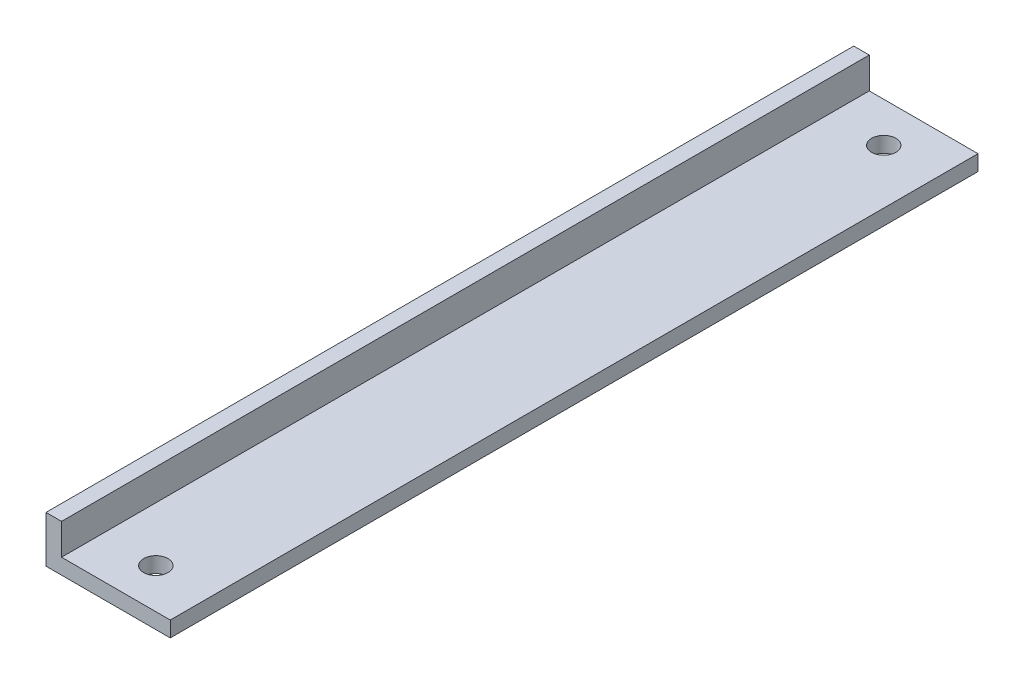
ISO-10303-21;
HEADER;
FILE_DESCRIPTION(('STEP AP214'),'2;1');
FILE_NAME('part.step','',(''),(''),'','','');
FILE_SCHEMA(('AUTOMOTIVE_DESIGN { 1 0 10303 214 1 1 1 1 }'));
ENDSEC;
DATA;
#1=APPLICATION_CONTEXT('core data for automotive mechanical design processes');
#2=APPLICATION_PROTOCOL_DEFINITION('international standard','automotive_design',2000,#1);
#3=PRODUCT_CONTEXT('',#1,'mechanical');
#4=PRODUCT('Part','Part','',(#3));
#5=PRODUCT_RELATED_PRODUCT_CATEGORY('part','',(#4));
#6=PRODUCT_DEFINITION_FORMATION('','',#4);
#7=PRODUCT_DEFINITION_CONTEXT('part definition',#1,'design');
#8=PRODUCT_DEFINITION('design','',#6,#7);
#9=PRODUCT_DEFINITION_SHAPE('','',#8);
#10=(LENGTH_UNIT() NAMED_UNIT(*) SI_UNIT(.MILLI.,.METRE.));
#11=(NAMED_UNIT(*) PLANE_ANGLE_UNIT() SI_UNIT($,.RADIAN.));
#12=(NAMED_UNIT(*) SI_UNIT($,.STERADIAN.) SOLID_ANGLE_UNIT());
#13=UNCERTAINTY_MEASURE_WITH_UNIT(LENGTH_MEASURE(1.E-05),#10,'distance_accuracy_value','');
#14=(GEOMETRIC_REPRESENTATION_CONTEXT(3) GLOBAL_UNCERTAINTY_ASSIGNED_CONTEXT((#13)) GLOBAL_UNIT_ASSIGNED_CONTEXT((#10,
#11,#12)) REPRESENTATION_CONTEXT('',''));
#15=CARTESIAN_POINT('',(0.,0.,0.));
#16=DIRECTION('',(0.,0.,1.));
#17=DIRECTION('',(1.,0.,0.));
#18=AXIS2_PLACEMENT_3D('',#15,#16,#17);
#19=CARTESIAN_POINT('',(0.,9.525,82.55));
#20=DIRECTION('',(0.,1.,0.));
#21=DIRECTION('',(0.,0.,1.));
#22=AXIS2_PLACEMENT_3D('',#19,#20,#21);
#23=PLANE('',#22);
#24=DIRECTION('',(1.,0.,0.));
#25=VECTOR('',#24,1.);
#26=CARTESIAN_POINT('',(0.,9.525,-82.55));
#27=LINE('',#26,#25);
#28=CARTESIAN_POINT('',(0.,9.525,-82.55));
#29=VERTEX_POINT('',#28);
#30=CARTESIAN_POINT('',(3.175,9.525,-82.55));
#31=VERTEX_POINT('',#30);
#32=EDGE_CURVE('E117',#29,#31,#27,.T.);
#33=ORIENTED_EDGE('',*,*,#32,.F.);
#34=DIRECTION('',(0.,0.,-1.));
#35=VECTOR('',#34,1.);
#36=CARTESIAN_POINT('',(0.,9.525,82.55));
#37=LINE('',#36,#35);
#38=CARTESIAN_POINT('',(0.,9.525,82.55));
#39=VERTEX_POINT('',#38);
#40=EDGE_CURVE('E11',#39,#29,#37,.T.);
#41=ORIENTED_EDGE('',*,*,#40,.F.);
#42=DIRECTION('',(1.,0.,0.));
#43=VECTOR('',#42,1.);
#44=CARTESIAN_POINT('',(0.,9.525,82.55));
#45=LINE('',#44,#43);
#46=CARTESIAN_POINT('',(3.175,9.525,82.55));
#47=VERTEX_POINT('',#46);
#48=EDGE_CURVE('E128',#39,#47,#45,.T.);
#49=ORIENTED_EDGE('',*,*,#48,.T.);
#50=DIRECTION('',(0.,0.,-1.));
#51=VECTOR('',#50,1.);
#52=CARTESIAN_POINT('',(3.175,9.525,82.55));
#53=LINE('',#52,#51);
#54=EDGE_CURVE('E81',#47,#31,#53,.T.);
#55=ORIENTED_EDGE('',*,*,#54,.T.);
#56=EDGE_LOOP('',(#33,#41,#49,#55));
#57=FACE_BOUND('',#56,.T.);
#58=ADVANCED_FACE('F34',(#57),#23,.T.);
#59=CARTESIAN_POINT('',(0.,0.,82.55));
#60=DIRECTION('',(1.,0.,0.));
#61=DIRECTION('',(0.,0.,-1.));
#62=AXIS2_PLACEMENT_3D('',#59,#60,#61);
#63=PLANE('',#62);
#64=DIRECTION('',(0.,-1.,0.));
#65=VECTOR('',#64,1.);
#66=CARTESIAN_POINT('',(0.,0.,-82.55));
#67=LINE('',#66,#65);
#68=CARTESIAN_POINT('',(0.,0.,-82.55));
#69=VERTEX_POINT('',#68);
#70=EDGE_CURVE('E120',#29,#69,#67,.T.);
#71=ORIENTED_EDGE('',*,*,#70,.T.);
#72=DIRECTION('',(0.,0.,-1.));
#73=VECTOR('',#72,1.);
#74=CARTESIAN_POINT('',(0.,0.,82.55));
#75=LINE('',#74,#73);
#76=CARTESIAN_POINT('',(0.,0.,82.55));
#77=VERTEX_POINT('',#76);
#78=EDGE_CURVE('E43',#77,#69,#75,.T.);
#79=ORIENTED_EDGE('',*,*,#78,.F.);
#80=DIRECTION('',(0.,-1.,0.));
#81=VECTOR('',#80,1.);
#82=CARTESIAN_POINT('',(0.,0.,82.55));
#83=LINE('',#82,#81);
#84=EDGE_CURVE('E148',#39,#77,#83,.T.);
#85=ORIENTED_EDGE('',*,*,#84,.F.);
#86=ORIENTED_EDGE('',*,*,#40,.T.);
#87=EDGE_LOOP('',(#71,#79,#85,#86));
#88=FACE_BOUND('',#87,.T.);
#89=ADVANCED_FACE('F151',(#88),#63,.F.);
#90=CARTESIAN_POINT('',(0.,0.,82.55));
#91=DIRECTION('',(0.,1.,0.));
#92=DIRECTION('',(0.,0.,1.));
#93=AXIS2_PLACEMENT_3D('',#90,#91,#92);
#94=PLANE('',#93);
#95=CARTESIAN_POINT('',(14.2875,0.,-74.3926249));
#96=DIRECTION('',(0.,1.,0.));
#97=DIRECTION('',(0.,0.,1.));
#98=AXIS2_PLACEMENT_3D('',#95,#96,#97);
#99=CIRCLE('',#98,2.48919999999999);
#100=CARTESIAN_POINT('',(14.2875,0.,-71.9034249));
#101=VERTEX_POINT('',#100);
#102=EDGE_CURVE('E135',#101,#101,#99,.T.);
#103=ORIENTED_EDGE('',*,*,#102,.T.);
#104=EDGE_LOOP('',(#103));
#105=FACE_BOUND('',#104,.T.);
#106=CARTESIAN_POINT('',(14.2875000000001,0.,74.3926249));
#107=DIRECTION('',(0.,1.,0.));
#108=DIRECTION('',(0.,0.,1.));
#109=AXIS2_PLACEMENT_3D('',#106,#107,#108);
#110=CIRCLE('',#109,2.48919999999999);
#111=CARTESIAN_POINT('',(14.2875000000001,0.,76.8818249));
#112=VERTEX_POINT('',#111);
#113=EDGE_CURVE('E140',#112,#112,#110,.T.);
#114=ORIENTED_EDGE('',*,*,#113,.T.);
#115=EDGE_LOOP('',(#114));
#116=FACE_BOUND('',#115,.T.);
#117=DIRECTION('',(1.,0.,0.));
#118=VECTOR('',#117,1.);
#119=CARTESIAN_POINT('',(0.,0.,-82.55));
#120=LINE('',#119,#118);
#121=CARTESIAN_POINT('',(25.4,0.,-82.55));
#122=VERTEX_POINT('',#121);
#123=EDGE_CURVE('E122',#69,#122,#120,.T.);
#124=ORIENTED_EDGE('',*,*,#123,.T.);
#125=DIRECTION('',(0.,0.,-1.));
#126=VECTOR('',#125,1.);
#127=CARTESIAN_POINT('',(25.4,0.,82.55));
#128=LINE('',#127,#126);
#129=CARTESIAN_POINT('',(25.4,0.,82.55));
#130=VERTEX_POINT('',#129);
#131=EDGE_CURVE('E109',#130,#122,#128,.T.);
#132=ORIENTED_EDGE('',*,*,#131,.F.);
#133=DIRECTION('',(1.,0.,0.));
#134=VECTOR('',#133,1.);
#135=CARTESIAN_POINT('',(0.,0.,82.55));
#136=LINE('',#135,#134);
#137=EDGE_CURVE('E100',#77,#130,#136,.T.);
#138=ORIENTED_EDGE('',*,*,#137,.F.);
#139=ORIENTED_EDGE('',*,*,#78,.T.);
#140=EDGE_LOOP('',(#124,#132,#138,#139));
#141=FACE_BOUND('',#140,.T.);
#142=ADVANCED_FACE('F155',(#105,#116,#141),#94,.F.);
#143=CARTESIAN_POINT('',(25.4,0.,82.55));
#144=DIRECTION('',(-1.,0.,0.));
#145=DIRECTION('',(0.,-1.,0.));
#146=AXIS2_PLACEMENT_3D('',#143,#144,#145);
#147=PLANE('',#146);
#148=DIRECTION('',(0.,1.,0.));
#149=VECTOR('',#148,1.);
#150=CARTESIAN_POINT('',(25.4,0.,-82.55));
#151=LINE('',#150,#149);
#152=CARTESIAN_POINT('',(25.4,3.175,-82.55));
#153=VERTEX_POINT('',#152);
#154=EDGE_CURVE('E108',#122,#153,#151,.T.);
#155=ORIENTED_EDGE('',*,*,#154,.T.);
#156=DIRECTION('',(0.,0.,-1.));
#157=VECTOR('',#156,1.);
#158=CARTESIAN_POINT('',(25.4,3.175,82.55));
#159=LINE('',#158,#157);
#160=CARTESIAN_POINT('',(25.4,3.175,82.55));
#161=VERTEX_POINT('',#160);
#162=EDGE_CURVE('E105',#161,#153,#159,.T.);
#163=ORIENTED_EDGE('',*,*,#162,.F.);
#164=DIRECTION('',(0.,1.,0.));
#165=VECTOR('',#164,1.);
#166=CARTESIAN_POINT('',(25.4,0.,82.55));
#167=LINE('',#166,#165);
#168=EDGE_CURVE('E94',#130,#161,#167,.T.);
#169=ORIENTED_EDGE('',*,*,#168,.F.);
#170=ORIENTED_EDGE('',*,*,#131,.T.);
#171=EDGE_LOOP('',(#155,#163,#169,#170));
#172=FACE_BOUND('',#171,.T.);
#173=ADVANCED_FACE('F106',(#172),#147,.F.);
#174=CARTESIAN_POINT('',(0.,3.175,82.55));
#175=DIRECTION('',(0.,-1.,0.));
#176=DIRECTION('',(1.,0.,0.));
#177=AXIS2_PLACEMENT_3D('',#174,#175,#176);
#178=PLANE('',#177);
#179=CARTESIAN_POINT('',(14.2875,3.175,-74.3926249));
#180=DIRECTION('',(0.,-1.,0.));
#181=DIRECTION('',(1.,0.,0.));
#182=AXIS2_PLACEMENT_3D('',#179,#180,#181);
#183=CIRCLE('',#182,2.48919999999999);
#184=CARTESIAN_POINT('',(16.7767,3.175,-74.3926249));
#185=VERTEX_POINT('',#184);
#186=EDGE_CURVE('E37',#185,#185,#183,.F.);
#187=ORIENTED_EDGE('',*,*,#186,.F.);
#188=EDGE_LOOP('',(#187));
#189=FACE_BOUND('',#188,.T.);
#190=CARTESIAN_POINT('',(14.2875000000001,3.175,74.3926249));
#191=DIRECTION('',(0.,-1.,0.));
#192=DIRECTION('',(1.,0.,0.));
#193=AXIS2_PLACEMENT_3D('',#190,#191,#192);
#194=CIRCLE('',#193,2.48919999999999);
#195=CARTESIAN_POINT('',(16.7767000000001,3.175,74.3926249));
#196=VERTEX_POINT('',#195);
#197=EDGE_CURVE('E133',#196,#196,#194,.F.);
#198=ORIENTED_EDGE('',*,*,#197,.F.);
#199=EDGE_LOOP('',(#198));
#200=FACE_BOUND('',#199,.T.);
#201=DIRECTION('',(-1.,0.,0.));
#202=VECTOR('',#201,1.);
#203=CARTESIAN_POINT('',(0.,3.175,-82.55));
#204=LINE('',#203,#202);
#205=CARTESIAN_POINT('',(3.175,3.175,-82.55));
#206=VERTEX_POINT('',#205);
#207=EDGE_CURVE('E74',#153,#206,#204,.T.);
#208=ORIENTED_EDGE('',*,*,#207,.T.);
#209=DIRECTION('',(0.,0.,-1.));
#210=VECTOR('',#209,1.);
#211=CARTESIAN_POINT('',(3.175,3.175,82.55));
#212=LINE('',#211,#210);
#213=CARTESIAN_POINT('',(3.175,3.175,82.55));
#214=VERTEX_POINT('',#213);
#215=EDGE_CURVE('E110',#214,#206,#212,.T.);
#216=ORIENTED_EDGE('',*,*,#215,.F.);
#217=DIRECTION('',(-1.,0.,0.));
#218=VECTOR('',#217,1.);
#219=CARTESIAN_POINT('',(0.,3.175,82.55));
#220=LINE('',#219,#218);
#221=EDGE_CURVE('E98',#161,#214,#220,.T.);
#222=ORIENTED_EDGE('',*,*,#221,.F.);
#223=ORIENTED_EDGE('',*,*,#162,.T.);
#224=EDGE_LOOP('',(#208,#216,#222,#223));
#225=FACE_BOUND('',#224,.T.);
#226=ADVANCED_FACE('F112',(#189,#200,#225),#178,.F.);
#227=CARTESIAN_POINT('',(3.175,0.,82.55));
#228=DIRECTION('',(-1.,0.,0.));
#229=DIRECTION('',(0.,-1.,0.));
#230=AXIS2_PLACEMENT_3D('',#227,#228,#229);
#231=PLANE('',#230);
#232=DIRECTION('',(0.,1.,0.));
#233=VECTOR('',#232,1.);
#234=CARTESIAN_POINT('',(3.175,0.,-82.55));
#235=LINE('',#234,#233);
#236=EDGE_CURVE('E126',#206,#31,#235,.T.);
#237=ORIENTED_EDGE('',*,*,#236,.T.);
#238=ORIENTED_EDGE('',*,*,#54,.F.);
#239=DIRECTION('',(0.,1.,0.));
#240=VECTOR('',#239,1.);
#241=CARTESIAN_POINT('',(3.175,0.,82.55));
#242=LINE('',#241,#240);
#243=EDGE_CURVE('E52',#214,#47,#242,.T.);
#244=ORIENTED_EDGE('',*,*,#243,.F.);
#245=ORIENTED_EDGE('',*,*,#215,.T.);
#246=EDGE_LOOP('',(#237,#238,#244,#245));
#247=FACE_BOUND('',#246,.T.);
#248=ADVANCED_FACE('F160',(#247),#231,.F.);
#249=CARTESIAN_POINT('',(0.,0.,82.55));
#250=DIRECTION('',(0.,0.,1.));
#251=DIRECTION('',(1.,0.,0.));
#252=AXIS2_PLACEMENT_3D('',#249,#250,#251);
#253=PLANE('',#252);
#254=ORIENTED_EDGE('',*,*,#48,.F.);
#255=ORIENTED_EDGE('',*,*,#84,.T.);
#256=ORIENTED_EDGE('',*,*,#137,.T.);
#257=ORIENTED_EDGE('',*,*,#168,.T.);
#258=ORIENTED_EDGE('',*,*,#221,.T.);
#259=ORIENTED_EDGE('',*,*,#243,.T.);
#260=EDGE_LOOP('',(#254,#255,#256,#257,#258,#259));
#261=FACE_BOUND('',#260,.T.);
#262=ADVANCED_FACE('F96',(#261),#253,.T.);
#263=CARTESIAN_POINT('',(0.,0.,-82.55));
#264=DIRECTION('',(0.,0.,1.));
#265=DIRECTION('',(1.,0.,0.));
#266=AXIS2_PLACEMENT_3D('',#263,#264,#265);
#267=PLANE('',#266);
#268=ORIENTED_EDGE('',*,*,#32,.T.);
#269=ORIENTED_EDGE('',*,*,#236,.F.);
#270=ORIENTED_EDGE('',*,*,#207,.F.);
#271=ORIENTED_EDGE('',*,*,#154,.F.);
#272=ORIENTED_EDGE('',*,*,#123,.F.);
#273=ORIENTED_EDGE('',*,*,#70,.F.);
#274=EDGE_LOOP('',(#268,#269,#270,#271,#272,#273));
#275=FACE_BOUND('',#274,.T.);
#276=ADVANCED_FACE('F157',(#275),#267,.F.);
#277=CARTESIAN_POINT('',(14.2875000000001,9.525,74.3926249));
#278=DIRECTION('',(0.,-1.,0.));
#279=DIRECTION('',(0.,0.,-1.));
#280=AXIS2_PLACEMENT_3D('',#277,#278,#279);
#281=CYLINDRICAL_SURFACE('',#280,2.48919999999999);
#282=ORIENTED_EDGE('',*,*,#113,.F.);
#283=EDGE_LOOP('',(#282));
#284=FACE_BOUND('',#283,.T.);
#285=ORIENTED_EDGE('',*,*,#197,.T.);
#286=EDGE_LOOP('',(#285));
#287=FACE_BOUND('',#286,.T.);
#288=ADVANCED_FACE('F179',(#284,#287),#281,.F.);
#289=CARTESIAN_POINT('',(14.2875,9.525,-74.3926249));
#290=DIRECTION('',(0.,-1.,0.));
#291=DIRECTION('',(0.,0.,-1.));
#292=AXIS2_PLACEMENT_3D('',#289,#290,#291);
#293=CYLINDRICAL_SURFACE('',#292,2.48919999999999);
#294=ORIENTED_EDGE('',*,*,#102,.F.);
#295=EDGE_LOOP('',(#294));
#296=FACE_BOUND('',#295,.T.);
#297=ORIENTED_EDGE('',*,*,#186,.T.);
#298=EDGE_LOOP('',(#297));
#299=FACE_BOUND('',#298,.T.);
#300=ADVANCED_FACE('F184',(#296,#299),#293,.F.);
#301=CLOSED_SHELL('',(#58,#89,#142,#173,#226,#248,#262,#276,#288,#300));
#302=MANIFOLD_SOLID_BREP('B2',#301);
#303=ADVANCED_BREP_SHAPE_REPRESENTATION('',(#18,#302),#14);
#304=SHAPE_DEFINITION_REPRESENTATION(#9,#303);
ENDSEC;
END-ISO-10303-21;
